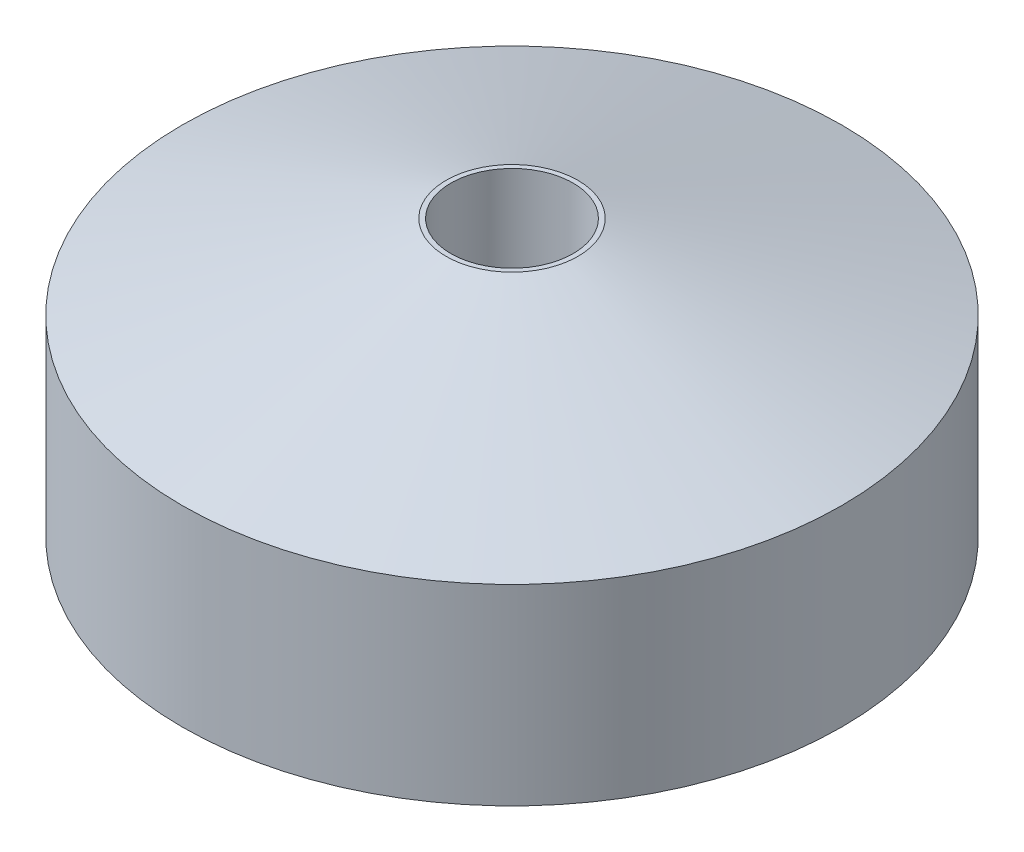
ISO-10303-21;
HEADER;
FILE_DESCRIPTION(('STEP AP214'),'2;1');
FILE_NAME('part.step','',(''),(''),'','','');
FILE_SCHEMA(('AUTOMOTIVE_DESIGN { 1 0 10303 214 1 1 1 1 }'));
ENDSEC;
DATA;
#1=APPLICATION_CONTEXT('core data for automotive mechanical design processes');
#2=APPLICATION_PROTOCOL_DEFINITION('international standard','automotive_design',2000,#1);
#3=PRODUCT_CONTEXT('',#1,'mechanical');
#4=PRODUCT('Part','Part','',(#3));
#5=PRODUCT_RELATED_PRODUCT_CATEGORY('part','',(#4));
#6=PRODUCT_DEFINITION_FORMATION('','',#4);
#7=PRODUCT_DEFINITION_CONTEXT('part definition',#1,'design');
#8=PRODUCT_DEFINITION('design','',#6,#7);
#9=PRODUCT_DEFINITION_SHAPE('','',#8);
#10=(LENGTH_UNIT() NAMED_UNIT(*) SI_UNIT(.MILLI.,.METRE.));
#11=(NAMED_UNIT(*) PLANE_ANGLE_UNIT() SI_UNIT($,.RADIAN.));
#12=(NAMED_UNIT(*) SI_UNIT($,.STERADIAN.) SOLID_ANGLE_UNIT());
#13=UNCERTAINTY_MEASURE_WITH_UNIT(LENGTH_MEASURE(1.E-05),#10,'distance_accuracy_value','');
#14=(GEOMETRIC_REPRESENTATION_CONTEXT(3) GLOBAL_UNCERTAINTY_ASSIGNED_CONTEXT((#13)) GLOBAL_UNIT_ASSIGNED_CONTEXT((#10,
#11,#12)) REPRESENTATION_CONTEXT('',''));
#15=CARTESIAN_POINT('',(0.,0.,0.));
#16=DIRECTION('',(0.,0.,1.));
#17=DIRECTION('',(1.,0.,0.));
#18=AXIS2_PLACEMENT_3D('',#15,#16,#17);
#19=CARTESIAN_POINT('',(0.,23.,0.));
#20=DIRECTION('',(0.,1.,0.));
#21=DIRECTION('',(0.,0.,1.));
#22=AXIS2_PLACEMENT_3D('',#19,#20,#21);
#23=CYLINDRICAL_SURFACE('',#22,5.1);
#24=CARTESIAN_POINT('',(0.,23.,0.));
#25=DIRECTION('',(0.,1.,0.));
#26=DIRECTION('',(0.,0.,1.));
#27=AXIS2_PLACEMENT_3D('',#24,#25,#26);
#28=CIRCLE('',#27,5.1);
#29=CARTESIAN_POINT('',(0.,23.,5.1));
#30=VERTEX_POINT('',#29);
#31=EDGE_CURVE('E117',#30,#30,#28,.T.);
#32=ORIENTED_EDGE('',*,*,#31,.T.);
#33=EDGE_LOOP('',(#32));
#34=FACE_BOUND('',#33,.T.);
#35=CARTESIAN_POINT('',(0.,10.,0.));
#36=DIRECTION('',(0.,-1.,0.));
#37=DIRECTION('',(0.,0.,-1.));
#38=AXIS2_PLACEMENT_3D('',#35,#36,#37);
#39=CIRCLE('',#38,5.1);
#40=CARTESIAN_POINT('',(0.,10.,-5.1));
#41=VERTEX_POINT('',#40);
#42=EDGE_CURVE('E49',#41,#41,#39,.F.);
#43=ORIENTED_EDGE('',*,*,#42,.F.);
#44=EDGE_LOOP('',(#43));
#45=FACE_BOUND('',#44,.T.);
#46=ADVANCED_FACE('F45',(#34,#45),#23,.F.);
#47=CARTESIAN_POINT('',(0.,23.,0.));
#48=DIRECTION('',(0.,-1.,0.));
#49=DIRECTION('',(0.,0.,-1.));
#50=AXIS2_PLACEMENT_3D('',#47,#48,#49);
#51=CYLINDRICAL_SURFACE('',#50,27.5);
#52=CARTESIAN_POINT('',(0.,0.,0.));
#53=DIRECTION('',(0.,1.,0.));
#54=DIRECTION('',(0.,0.,1.));
#55=AXIS2_PLACEMENT_3D('',#52,#53,#54);
#56=CIRCLE('',#55,27.5);
#57=CARTESIAN_POINT('',(0.,0.,27.5));
#58=VERTEX_POINT('',#57);
#59=EDGE_CURVE('E11',#58,#58,#56,.T.);
#60=ORIENTED_EDGE('',*,*,#59,.T.);
#61=EDGE_LOOP('',(#60));
#62=FACE_BOUND('',#61,.T.);
#63=CARTESIAN_POINT('',(0.,16.,0.));
#64=DIRECTION('',(0.,-1.,0.));
#65=DIRECTION('',(0.,0.,-1.));
#66=AXIS2_PLACEMENT_3D('',#63,#64,#65);
#67=CIRCLE('',#66,27.5);
#68=CARTESIAN_POINT('',(0.,16.,-27.5));
#69=VERTEX_POINT('',#68);
#70=EDGE_CURVE('E121',#69,#69,#67,.T.);
#71=ORIENTED_EDGE('',*,*,#70,.T.);
#72=EDGE_LOOP('',(#71));
#73=FACE_BOUND('',#72,.T.);
#74=ADVANCED_FACE('F47',(#62,#73),#51,.T.);
#75=CARTESIAN_POINT('',(0.,0.,0.));
#76=DIRECTION('',(0.,1.,0.));
#77=DIRECTION('',(0.,0.,1.));
#78=AXIS2_PLACEMENT_3D('',#75,#76,#77);
#79=PLANE('',#78);
#80=CARTESIAN_POINT('',(0.,0.,20.));
#81=DIRECTION('',(0.,-1.,0.));
#82=DIRECTION('',(0.,0.,-1.));
#83=AXIS2_PLACEMENT_3D('',#80,#81,#82);
#84=CIRCLE('',#83,3.39999999999999);
#85=CARTESIAN_POINT('',(0.,0.,16.6));
#86=VERTEX_POINT('',#85);
#87=EDGE_CURVE('E80',#86,#86,#84,.T.);
#88=ORIENTED_EDGE('',*,*,#87,.F.);
#89=EDGE_LOOP('',(#88));
#90=FACE_BOUND('',#89,.T.);
#91=CARTESIAN_POINT('',(20.0000000000006,0.,5.64760248210638E-13));
#92=DIRECTION('',(0.,-1.,0.));
#93=DIRECTION('',(0.,0.,-1.));
#94=AXIS2_PLACEMENT_3D('',#91,#92,#93);
#95=CIRCLE('',#94,3.39999999999999);
#96=CARTESIAN_POINT('',(20.0000000000006,0.,-3.39999999999943));
#97=VERTEX_POINT('',#96);
#98=EDGE_CURVE('E79',#97,#97,#95,.T.);
#99=ORIENTED_EDGE('',*,*,#98,.F.);
#100=EDGE_LOOP('',(#99));
#101=FACE_BOUND('',#100,.T.);
#102=CARTESIAN_POINT('',(1.12952049642128E-12,0.,-20.));
#103=DIRECTION('',(0.,-1.,0.));
#104=DIRECTION('',(0.,0.,-1.));
#105=AXIS2_PLACEMENT_3D('',#102,#103,#104);
#106=CIRCLE('',#105,3.39999999999999);
#107=CARTESIAN_POINT('',(1.12952049642128E-12,0.,-23.4));
#108=VERTEX_POINT('',#107);
#109=EDGE_CURVE('E93',#108,#108,#106,.T.);
#110=ORIENTED_EDGE('',*,*,#109,.F.);
#111=EDGE_LOOP('',(#110));
#112=FACE_BOUND('',#111,.T.);
#113=CARTESIAN_POINT('',(-19.9999999999994,0.,-5.62310954612343E-13));
#114=DIRECTION('',(0.,-1.,0.));
#115=DIRECTION('',(0.,0.,-1.));
#116=AXIS2_PLACEMENT_3D('',#113,#114,#115);
#117=CIRCLE('',#116,3.39999999999999);
#118=CARTESIAN_POINT('',(-19.9999999999994,0.,-3.40000000000055));
#119=VERTEX_POINT('',#118);
#120=EDGE_CURVE('E101',#119,#119,#117,.T.);
#121=ORIENTED_EDGE('',*,*,#120,.F.);
#122=EDGE_LOOP('',(#121));
#123=FACE_BOUND('',#122,.T.);
#124=CARTESIAN_POINT('',(0.,0.,0.));
#125=DIRECTION('',(0.,-1.,0.));
#126=DIRECTION('',(0.,0.,-1.));
#127=AXIS2_PLACEMENT_3D('',#124,#125,#126);
#128=CIRCLE('',#127,11.);
#129=CARTESIAN_POINT('',(0.,0.,-11.));
#130=VERTEX_POINT('',#129);
#131=EDGE_CURVE('E109',#130,#130,#128,.T.);
#132=ORIENTED_EDGE('',*,*,#131,.F.);
#133=EDGE_LOOP('',(#132));
#134=FACE_BOUND('',#133,.T.);
#135=ORIENTED_EDGE('',*,*,#59,.F.);
#136=EDGE_LOOP('',(#135));
#137=FACE_BOUND('',#136,.T.);
#138=ADVANCED_FACE('F144',(#90,#101,#112,#123,#134,#137),#79,.F.);
#139=CARTESIAN_POINT('',(0.,16.,0.));
#140=DIRECTION('',(0.,-1.,0.));
#141=DIRECTION('',(0.,0.,-1.));
#142=AXIS2_PLACEMENT_3D('',#139,#140,#141);
#143=CONICAL_SURFACE('',#142,27.5,1.26274354577112);
#144=CARTESIAN_POINT('',(0.,23.,0.));
#145=DIRECTION('',(0.,-1.,0.));
#146=DIRECTION('',(0.,0.,-1.));
#147=AXIS2_PLACEMENT_3D('',#144,#145,#146);
#148=CIRCLE('',#147,5.5);
#149=CARTESIAN_POINT('',(0.,23.,-5.5));
#150=VERTEX_POINT('',#149);
#151=EDGE_CURVE('E55',#150,#150,#148,.T.);
#152=ORIENTED_EDGE('',*,*,#151,.T.);
#153=EDGE_LOOP('',(#152));
#154=FACE_BOUND('',#153,.T.);
#155=ORIENTED_EDGE('',*,*,#70,.F.);
#156=EDGE_LOOP('',(#155));
#157=FACE_BOUND('',#156,.T.);
#158=ADVANCED_FACE('F129',(#154,#157),#143,.T.);
#159=CARTESIAN_POINT('',(0.,23.,0.));
#160=DIRECTION('',(0.,1.,0.));
#161=DIRECTION('',(0.,0.,1.));
#162=AXIS2_PLACEMENT_3D('',#159,#160,#161);
#163=PLANE('',#162);
#164=ORIENTED_EDGE('',*,*,#31,.F.);
#165=EDGE_LOOP('',(#164));
#166=FACE_BOUND('',#165,.T.);
#167=ORIENTED_EDGE('',*,*,#151,.F.);
#168=EDGE_LOOP('',(#167));
#169=FACE_BOUND('',#168,.T.);
#170=ADVANCED_FACE('F132',(#166,#169),#163,.T.);
#171=CARTESIAN_POINT('',(0.,10.,0.));
#172=DIRECTION('',(0.,-1.,0.));
#173=DIRECTION('',(0.,0.,-1.));
#174=AXIS2_PLACEMENT_3D('',#171,#172,#173);
#175=PLANE('',#174);
#176=CARTESIAN_POINT('',(0.,10.,0.));
#177=DIRECTION('',(0.,-1.,0.));
#178=DIRECTION('',(0.,0.,-1.));
#179=AXIS2_PLACEMENT_3D('',#176,#177,#178);
#180=CIRCLE('',#179,11.);
#181=CARTESIAN_POINT('',(0.,10.,-11.));
#182=VERTEX_POINT('',#181);
#183=EDGE_CURVE('E110',#182,#182,#180,.T.);
#184=ORIENTED_EDGE('',*,*,#183,.T.);
#185=EDGE_LOOP('',(#184));
#186=FACE_BOUND('',#185,.T.);
#187=ORIENTED_EDGE('',*,*,#42,.T.);
#188=EDGE_LOOP('',(#187));
#189=FACE_BOUND('',#188,.T.);
#190=ADVANCED_FACE('F134',(#186,#189),#175,.T.);
#191=CARTESIAN_POINT('',(0.,10.,0.));
#192=DIRECTION('',(0.,-1.,0.));
#193=DIRECTION('',(0.,0.,-1.));
#194=AXIS2_PLACEMENT_3D('',#191,#192,#193);
#195=CYLINDRICAL_SURFACE('',#194,11.);
#196=ORIENTED_EDGE('',*,*,#183,.F.);
#197=EDGE_LOOP('',(#196));
#198=FACE_BOUND('',#197,.T.);
#199=ORIENTED_EDGE('',*,*,#131,.T.);
#200=EDGE_LOOP('',(#199));
#201=FACE_BOUND('',#200,.T.);
#202=ADVANCED_FACE('F141',(#198,#201),#195,.F.);
#203=CARTESIAN_POINT('',(-19.9999999999994,16.,-5.62310954612343E-13));
#204=DIRECTION('',(0.,-1.,0.));
#205=DIRECTION('',(0.,0.,-1.));
#206=AXIS2_PLACEMENT_3D('',#203,#204,#205);
#207=CONICAL_SURFACE('',#206,3.4,1.02974425867665);
#208=CARTESIAN_POINT('',(-19.9999999999994,18.0429261046937,-5.62310954612343E-13));
#209=VERTEX_POINT('',#208);
#210=VERTEX_LOOP('',#209);
#211=FACE_BOUND('',#210,.T.);
#212=CARTESIAN_POINT('',(-19.9999999999994,16.,-5.62310954612343E-13));
#213=DIRECTION('',(0.,-1.,0.));
#214=DIRECTION('',(0.,0.,-1.));
#215=AXIS2_PLACEMENT_3D('',#212,#213,#214);
#216=CIRCLE('',#215,3.4);
#217=CARTESIAN_POINT('',(-19.9999999999994,16.,-3.40000000000056));
#218=VERTEX_POINT('',#217);
#219=EDGE_CURVE('E105',#218,#218,#216,.T.);
#220=ORIENTED_EDGE('',*,*,#219,.T.);
#221=EDGE_LOOP('',(#220));
#222=FACE_BOUND('',#221,.T.);
#223=ADVANCED_FACE('F157',(#211,#222),#207,.F.);
#224=CARTESIAN_POINT('',(-19.9999999999994,0.,-5.62310954612343E-13));
#225=DIRECTION('',(0.,-1.,0.));
#226=DIRECTION('',(0.,0.,-1.));
#227=AXIS2_PLACEMENT_3D('',#224,#225,#226);
#228=CYLINDRICAL_SURFACE('',#227,3.39999999999999);
#229=ORIENTED_EDGE('',*,*,#219,.F.);
#230=EDGE_LOOP('',(#229));
#231=FACE_BOUND('',#230,.T.);
#232=ORIENTED_EDGE('',*,*,#120,.T.);
#233=EDGE_LOOP('',(#232));
#234=FACE_BOUND('',#233,.T.);
#235=ADVANCED_FACE('F162',(#231,#234),#228,.F.);
#236=CARTESIAN_POINT('',(1.12952049642128E-12,16.,-20.));
#237=DIRECTION('',(0.,-1.,0.));
#238=DIRECTION('',(0.,0.,-1.));
#239=AXIS2_PLACEMENT_3D('',#236,#237,#238);
#240=CONICAL_SURFACE('',#239,3.4,1.02974425867665);
#241=CARTESIAN_POINT('',(1.125101254081E-12,18.0429261046937,-20.));
#242=VERTEX_POINT('',#241);
#243=VERTEX_LOOP('',#242);
#244=FACE_BOUND('',#243,.T.);
#245=CARTESIAN_POINT('',(1.12952049642128E-12,16.,-20.));
#246=DIRECTION('',(0.,-1.,0.));
#247=DIRECTION('',(0.,0.,-1.));
#248=AXIS2_PLACEMENT_3D('',#245,#246,#247);
#249=CIRCLE('',#248,3.4);
#250=CARTESIAN_POINT('',(1.12952049642128E-12,16.,-23.4));
#251=VERTEX_POINT('',#250);
#252=EDGE_CURVE('E97',#251,#251,#249,.T.);
#253=ORIENTED_EDGE('',*,*,#252,.T.);
#254=EDGE_LOOP('',(#253));
#255=FACE_BOUND('',#254,.T.);
#256=ADVANCED_FACE('F165',(#244,#255),#240,.F.);
#257=CARTESIAN_POINT('',(1.12952049642128E-12,0.,-20.));
#258=DIRECTION('',(0.,-1.,0.));
#259=DIRECTION('',(0.,0.,-1.));
#260=AXIS2_PLACEMENT_3D('',#257,#258,#259);
#261=CYLINDRICAL_SURFACE('',#260,3.39999999999999);
#262=ORIENTED_EDGE('',*,*,#252,.F.);
#263=EDGE_LOOP('',(#262));
#264=FACE_BOUND('',#263,.T.);
#265=ORIENTED_EDGE('',*,*,#109,.T.);
#266=EDGE_LOOP('',(#265));
#267=FACE_BOUND('',#266,.T.);
#268=ADVANCED_FACE('F169',(#264,#267),#261,.F.);
#269=CARTESIAN_POINT('',(20.0000000000006,16.,5.64760248210638E-13));
#270=DIRECTION('',(0.,-1.,0.));
#271=DIRECTION('',(0.,0.,-1.));
#272=AXIS2_PLACEMENT_3D('',#269,#270,#271);
#273=CONICAL_SURFACE('',#272,3.4,1.02974425867665);
#274=CARTESIAN_POINT('',(20.0000000000006,18.0429261046937,5.64760248210638E-13));
#275=VERTEX_POINT('',#274);
#276=VERTEX_LOOP('',#275);
#277=FACE_BOUND('',#276,.T.);
#278=CARTESIAN_POINT('',(20.0000000000006,16.,5.64760248210638E-13));
#279=DIRECTION('',(0.,-1.,0.));
#280=DIRECTION('',(0.,0.,-1.));
#281=AXIS2_PLACEMENT_3D('',#278,#279,#280);
#282=CIRCLE('',#281,3.4);
#283=CARTESIAN_POINT('',(20.0000000000006,16.,-3.39999999999943));
#284=VERTEX_POINT('',#283);
#285=EDGE_CURVE('E85',#284,#284,#282,.T.);
#286=ORIENTED_EDGE('',*,*,#285,.T.);
#287=EDGE_LOOP('',(#286));
#288=FACE_BOUND('',#287,.T.);
#289=ADVANCED_FACE('F172',(#277,#288),#273,.F.);
#290=CARTESIAN_POINT('',(20.0000000000006,0.,5.64760248210638E-13));
#291=DIRECTION('',(0.,-1.,0.));
#292=DIRECTION('',(0.,0.,-1.));
#293=AXIS2_PLACEMENT_3D('',#290,#291,#292);
#294=CYLINDRICAL_SURFACE('',#293,3.39999999999999);
#295=ORIENTED_EDGE('',*,*,#285,.F.);
#296=EDGE_LOOP('',(#295));
#297=FACE_BOUND('',#296,.T.);
#298=ORIENTED_EDGE('',*,*,#98,.T.);
#299=EDGE_LOOP('',(#298));
#300=FACE_BOUND('',#299,.T.);
#301=ADVANCED_FACE('F72',(#297,#300),#294,.F.);
#302=CARTESIAN_POINT('',(0.,16.,20.));
#303=DIRECTION('',(0.,-1.,0.));
#304=DIRECTION('',(0.,0.,-1.));
#305=AXIS2_PLACEMENT_3D('',#302,#303,#304);
#306=CONICAL_SURFACE('',#305,3.4,1.02974425867665);
#307=CARTESIAN_POINT('',(0.,18.0429261046937,20.));
#308=VERTEX_POINT('',#307);
#309=VERTEX_LOOP('',#308);
#310=FACE_BOUND('',#309,.T.);
#311=CARTESIAN_POINT('',(0.,16.,20.));
#312=DIRECTION('',(0.,-1.,0.));
#313=DIRECTION('',(0.,0.,-1.));
#314=AXIS2_PLACEMENT_3D('',#311,#312,#313);
#315=CIRCLE('',#314,3.4);
#316=CARTESIAN_POINT('',(0.,16.,16.6));
#317=VERTEX_POINT('',#316);
#318=EDGE_CURVE('E76',#317,#317,#315,.T.);
#319=ORIENTED_EDGE('',*,*,#318,.T.);
#320=EDGE_LOOP('',(#319));
#321=FACE_BOUND('',#320,.T.);
#322=ADVANCED_FACE('F68',(#310,#321),#306,.F.);
#323=CARTESIAN_POINT('',(0.,0.,20.));
#324=DIRECTION('',(0.,-1.,0.));
#325=DIRECTION('',(0.,0.,-1.));
#326=AXIS2_PLACEMENT_3D('',#323,#324,#325);
#327=CYLINDRICAL_SURFACE('',#326,3.39999999999999);
#328=ORIENTED_EDGE('',*,*,#318,.F.);
#329=EDGE_LOOP('',(#328));
#330=FACE_BOUND('',#329,.T.);
#331=ORIENTED_EDGE('',*,*,#87,.T.);
#332=EDGE_LOOP('',(#331));
#333=FACE_BOUND('',#332,.T.);
#334=ADVANCED_FACE('F71',(#330,#333),#327,.F.);
#335=CLOSED_SHELL('',(#46,#74,#138,#158,#170,#190,#202,#223,#235,#256,#268,#289,#301,#322,#334));
#336=MANIFOLD_SOLID_BREP('B2',#335);
#337=ADVANCED_BREP_SHAPE_REPRESENTATION('',(#18,#336),#14);
#338=SHAPE_DEFINITION_REPRESENTATION(#9,#337);
ENDSEC;
END-ISO-10303-21;
